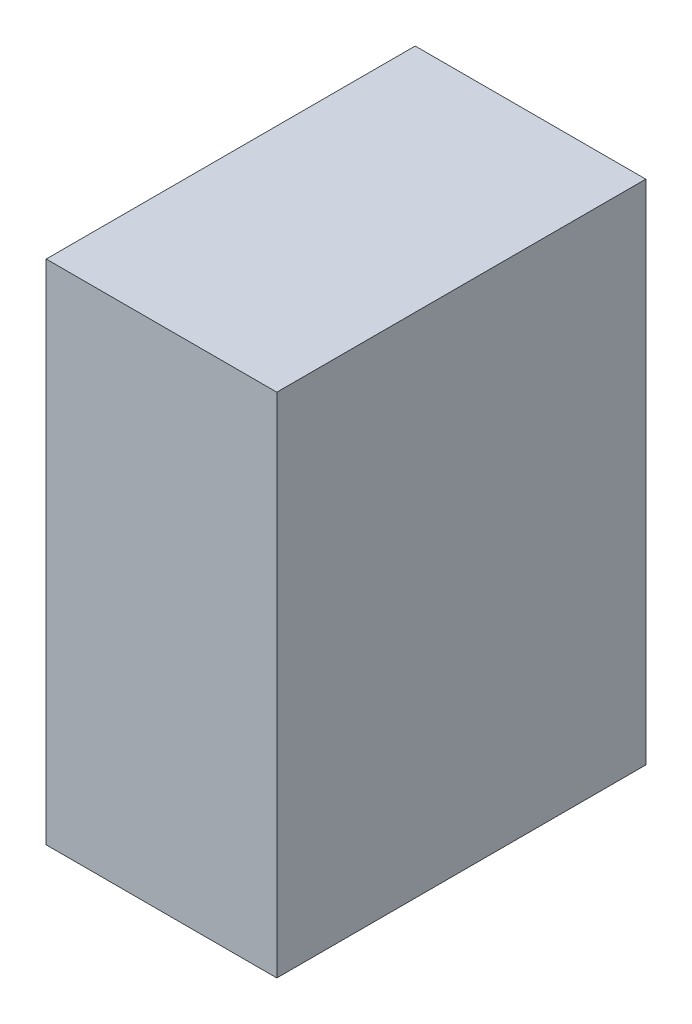
ISO-10303-21;
HEADER;
FILE_DESCRIPTION(('STEP AP214'),'2;1');
FILE_NAME('part.step','',(''),(''),'','','');
FILE_SCHEMA(('AUTOMOTIVE_DESIGN { 1 0 10303 214 1 1 1 1 }'));
ENDSEC;
DATA;
#1=APPLICATION_CONTEXT('core data for automotive mechanical design processes');
#2=APPLICATION_PROTOCOL_DEFINITION('international standard','automotive_design',2000,#1);
#3=PRODUCT_CONTEXT('',#1,'mechanical');
#4=PRODUCT('Part','Part','',(#3));
#5=PRODUCT_RELATED_PRODUCT_CATEGORY('part','',(#4));
#6=PRODUCT_DEFINITION_FORMATION('','',#4);
#7=PRODUCT_DEFINITION_CONTEXT('part definition',#1,'design');
#8=PRODUCT_DEFINITION('design','',#6,#7);
#9=PRODUCT_DEFINITION_SHAPE('','',#8);
#10=(LENGTH_UNIT() NAMED_UNIT(*) SI_UNIT(.MILLI.,.METRE.));
#11=(NAMED_UNIT(*) PLANE_ANGLE_UNIT() SI_UNIT($,.RADIAN.));
#12=(NAMED_UNIT(*) SI_UNIT($,.STERADIAN.) SOLID_ANGLE_UNIT());
#13=UNCERTAINTY_MEASURE_WITH_UNIT(LENGTH_MEASURE(1.E-05),#10,'distance_accuracy_value','');
#14=(GEOMETRIC_REPRESENTATION_CONTEXT(3) GLOBAL_UNCERTAINTY_ASSIGNED_CONTEXT((#13)) GLOBAL_UNIT_ASSIGNED_CONTEXT((#10,
#11,#12)) REPRESENTATION_CONTEXT('',''));
#15=CARTESIAN_POINT('',(0.,0.,0.));
#16=DIRECTION('',(0.,0.,1.));
#17=DIRECTION('',(1.,0.,0.));
#18=AXIS2_PLACEMENT_3D('',#15,#16,#17);
#19=CARTESIAN_POINT('',(-0.12499848,-0.27499818,0.));
#20=DIRECTION('',(-1.,0.,0.));
#21=DIRECTION('',(0.,1.,0.));
#22=AXIS2_PLACEMENT_3D('',#19,#20,#21);
#23=PLANE('',#22);
#24=DIRECTION('',(0.,0.,1.));
#25=VECTOR('',#24,1.);
#26=CARTESIAN_POINT('',(-0.12499848,-0.27499818,0.));
#27=LINE('',#26,#25);
#28=CARTESIAN_POINT('',(-0.12499848,-0.27499818,0.));
#29=VERTEX_POINT('',#28);
#30=CARTESIAN_POINT('',(-0.12499848,-0.27499818,0.3999992));
#31=VERTEX_POINT('',#30);
#32=EDGE_CURVE('E11',#29,#31,#27,.T.);
#33=ORIENTED_EDGE('',*,*,#32,.T.);
#34=DIRECTION('',(0.,1.,0.));
#35=VECTOR('',#34,1.);
#36=CARTESIAN_POINT('',(-0.12499848,-0.27499818,0.3999992));
#37=LINE('',#36,#35);
#38=CARTESIAN_POINT('',(-0.12499848,0.27500072,0.3999992));
#39=VERTEX_POINT('',#38);
#40=EDGE_CURVE('E24',#31,#39,#37,.T.);
#41=ORIENTED_EDGE('',*,*,#40,.T.);
#42=DIRECTION('',(0.,0.,1.));
#43=VECTOR('',#42,1.);
#44=CARTESIAN_POINT('',(-0.12499848,0.27500072,0.));
#45=LINE('',#44,#43);
#46=CARTESIAN_POINT('',(-0.12499848,0.27500072,0.));
#47=VERTEX_POINT('',#46);
#48=EDGE_CURVE('E85',#47,#39,#45,.T.);
#49=ORIENTED_EDGE('',*,*,#48,.F.);
#50=DIRECTION('',(0.,1.,0.));
#51=VECTOR('',#50,1.);
#52=CARTESIAN_POINT('',(-0.12499848,-0.27499818,0.));
#53=LINE('',#52,#51);
#54=EDGE_CURVE('E83',#29,#47,#53,.T.);
#55=ORIENTED_EDGE('',*,*,#54,.F.);
#56=EDGE_LOOP('',(#33,#41,#49,#55));
#57=FACE_BOUND('',#56,.T.);
#58=ADVANCED_FACE('F17',(#57),#23,.T.);
#59=CARTESIAN_POINT('',(-0.12499848,0.27500072,0.));
#60=DIRECTION('',(0.,1.,0.));
#61=DIRECTION('',(1.,0.,0.));
#62=AXIS2_PLACEMENT_3D('',#59,#60,#61);
#63=PLANE('',#62);
#64=ORIENTED_EDGE('',*,*,#48,.T.);
#65=DIRECTION('',(1.,0.,0.));
#66=VECTOR('',#65,1.);
#67=CARTESIAN_POINT('',(-0.12499848,0.27500072,0.3999992));
#68=LINE('',#67,#66);
#69=CARTESIAN_POINT('',(0.12500102,0.27500072,0.3999992));
#70=VERTEX_POINT('',#69);
#71=EDGE_CURVE('E81',#39,#70,#68,.T.);
#72=ORIENTED_EDGE('',*,*,#71,.T.);
#73=DIRECTION('',(0.,0.,1.));
#74=VECTOR('',#73,1.);
#75=CARTESIAN_POINT('',(0.12500102,0.27500072,0.));
#76=LINE('',#75,#74);
#77=CARTESIAN_POINT('',(0.12500102,0.27500072,0.));
#78=VERTEX_POINT('',#77);
#79=EDGE_CURVE('E79',#78,#70,#76,.T.);
#80=ORIENTED_EDGE('',*,*,#79,.F.);
#81=DIRECTION('',(1.,0.,0.));
#82=VECTOR('',#81,1.);
#83=CARTESIAN_POINT('',(-0.12499848,0.27500072,0.));
#84=LINE('',#83,#82);
#85=EDGE_CURVE('E70',#47,#78,#84,.T.);
#86=ORIENTED_EDGE('',*,*,#85,.F.);
#87=EDGE_LOOP('',(#64,#72,#80,#86));
#88=FACE_BOUND('',#87,.T.);
#89=ADVANCED_FACE('F90',(#88),#63,.T.);
#90=CARTESIAN_POINT('',(0.12500102,0.27500072,0.));
#91=DIRECTION('',(1.,0.,0.));
#92=DIRECTION('',(0.,-1.,0.));
#93=AXIS2_PLACEMENT_3D('',#90,#91,#92);
#94=PLANE('',#93);
#95=ORIENTED_EDGE('',*,*,#79,.T.);
#96=DIRECTION('',(0.,-1.,0.));
#97=VECTOR('',#96,1.);
#98=CARTESIAN_POINT('',(0.12500102,0.27500072,0.3999992));
#99=LINE('',#98,#97);
#100=CARTESIAN_POINT('',(0.12500102,-0.27499818,0.3999992));
#101=VERTEX_POINT('',#100);
#102=EDGE_CURVE('E60',#70,#101,#99,.T.);
#103=ORIENTED_EDGE('',*,*,#102,.T.);
#104=DIRECTION('',(0.,0.,1.));
#105=VECTOR('',#104,1.);
#106=CARTESIAN_POINT('',(0.12500102,-0.27499818,0.));
#107=LINE('',#106,#105);
#108=CARTESIAN_POINT('',(0.12500102,-0.27499818,0.));
#109=VERTEX_POINT('',#108);
#110=EDGE_CURVE('E54',#109,#101,#107,.T.);
#111=ORIENTED_EDGE('',*,*,#110,.F.);
#112=DIRECTION('',(0.,-1.,0.));
#113=VECTOR('',#112,1.);
#114=CARTESIAN_POINT('',(0.12500102,0.27500072,0.));
#115=LINE('',#114,#113);
#116=EDGE_CURVE('E58',#78,#109,#115,.T.);
#117=ORIENTED_EDGE('',*,*,#116,.F.);
#118=EDGE_LOOP('',(#95,#103,#111,#117));
#119=FACE_BOUND('',#118,.T.);
#120=ADVANCED_FACE('F57',(#119),#94,.T.);
#121=CARTESIAN_POINT('',(0.12500102,-0.27499818,0.));
#122=DIRECTION('',(0.,-1.,0.));
#123=DIRECTION('',(-1.,0.,0.));
#124=AXIS2_PLACEMENT_3D('',#121,#122,#123);
#125=PLANE('',#124);
#126=ORIENTED_EDGE('',*,*,#110,.T.);
#127=DIRECTION('',(-1.,0.,0.));
#128=VECTOR('',#127,1.);
#129=CARTESIAN_POINT('',(0.12500102,-0.27499818,0.3999992));
#130=LINE('',#129,#128);
#131=EDGE_CURVE('E71',#101,#31,#130,.T.);
#132=ORIENTED_EDGE('',*,*,#131,.T.);
#133=ORIENTED_EDGE('',*,*,#32,.F.);
#134=DIRECTION('',(-1.,0.,0.));
#135=VECTOR('',#134,1.);
#136=CARTESIAN_POINT('',(0.12500102,-0.27499818,0.));
#137=LINE('',#136,#135);
#138=EDGE_CURVE('E68',#109,#29,#137,.T.);
#139=ORIENTED_EDGE('',*,*,#138,.F.);
#140=EDGE_LOOP('',(#126,#132,#133,#139));
#141=FACE_BOUND('',#140,.T.);
#142=ADVANCED_FACE('F73',(#141),#125,.T.);
#143=CARTESIAN_POINT('',(1.27000000205E-06,1.270000002064E-06,0.));
#144=DIRECTION('',(0.,0.,-1.));
#145=DIRECTION('',(-1.,0.,0.));
#146=AXIS2_PLACEMENT_3D('',#143,#144,#145);
#147=PLANE('',#146);
#148=ORIENTED_EDGE('',*,*,#54,.T.);
#149=ORIENTED_EDGE('',*,*,#85,.T.);
#150=ORIENTED_EDGE('',*,*,#116,.T.);
#151=ORIENTED_EDGE('',*,*,#138,.T.);
#152=EDGE_LOOP('',(#148,#149,#150,#151));
#153=FACE_BOUND('',#152,.T.);
#154=ADVANCED_FACE('F67',(#153),#147,.T.);
#155=CARTESIAN_POINT('',(1.27000000205E-06,1.270000002064E-06,0.3999992));
#156=DIRECTION('',(0.,0.,-1.));
#157=DIRECTION('',(-1.,0.,0.));
#158=AXIS2_PLACEMENT_3D('',#155,#156,#157);
#159=PLANE('',#158);
#160=ORIENTED_EDGE('',*,*,#131,.F.);
#161=ORIENTED_EDGE('',*,*,#102,.F.);
#162=ORIENTED_EDGE('',*,*,#71,.F.);
#163=ORIENTED_EDGE('',*,*,#40,.F.);
#164=EDGE_LOOP('',(#160,#161,#162,#163));
#165=FACE_BOUND('',#164,.T.);
#166=ADVANCED_FACE('F91',(#165),#159,.F.);
#167=CLOSED_SHELL('',(#58,#89,#120,#142,#154,#166));
#168=MANIFOLD_SOLID_BREP('B1',#167);
#169=ADVANCED_BREP_SHAPE_REPRESENTATION('',(#18,#168),#14);
#170=SHAPE_DEFINITION_REPRESENTATION(#9,#169);
ENDSEC;
END-ISO-10303-21;
